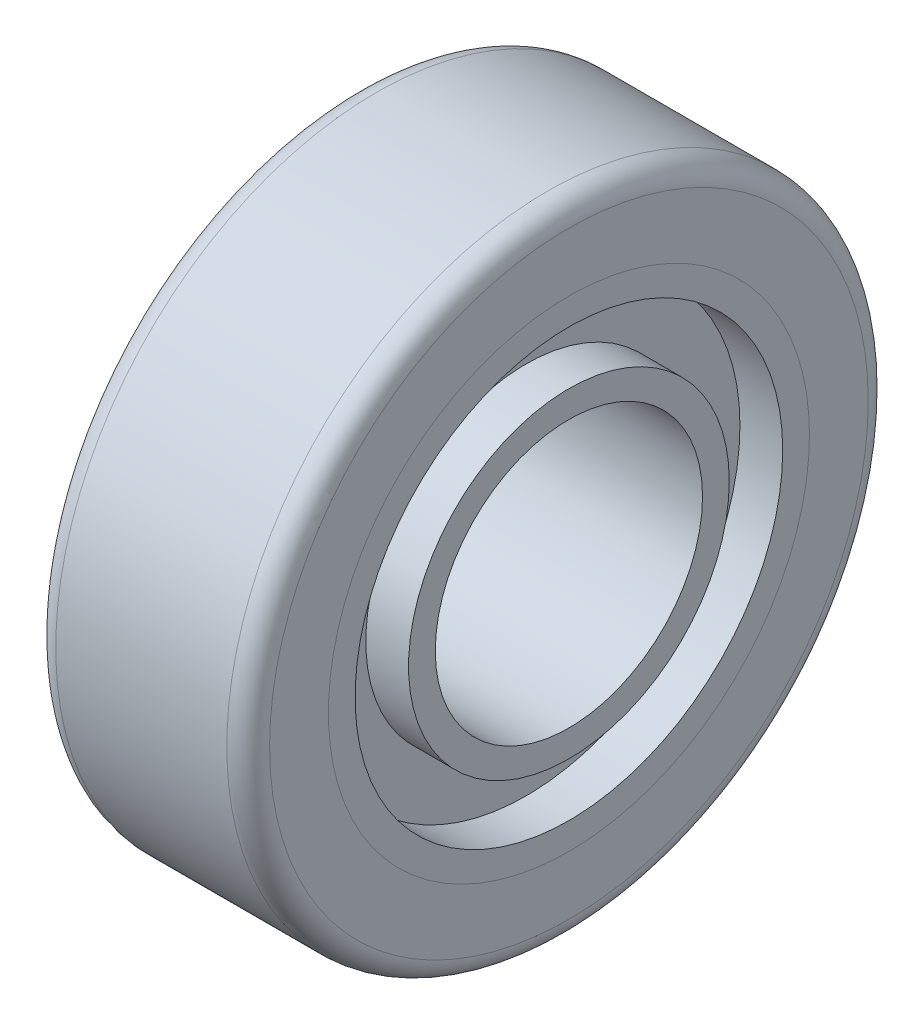
ISO-10303-21;
HEADER;
FILE_DESCRIPTION(('STEP AP214'),'2;1');
FILE_NAME('part.step','',(''),(''),'','','');
FILE_SCHEMA(('AUTOMOTIVE_DESIGN { 1 0 10303 214 1 1 1 1 }'));
ENDSEC;
DATA;
#1=APPLICATION_CONTEXT('core data for automotive mechanical design processes');
#2=APPLICATION_PROTOCOL_DEFINITION('international standard','automotive_design',2000,#1);
#3=PRODUCT_CONTEXT('',#1,'mechanical');
#4=PRODUCT('Part','Part','',(#3));
#5=PRODUCT_RELATED_PRODUCT_CATEGORY('part','',(#4));
#6=PRODUCT_DEFINITION_FORMATION('','',#4);
#7=PRODUCT_DEFINITION_CONTEXT('part definition',#1,'design');
#8=PRODUCT_DEFINITION('design','',#6,#7);
#9=PRODUCT_DEFINITION_SHAPE('','',#8);
#10=(LENGTH_UNIT() NAMED_UNIT(*) SI_UNIT(.MILLI.,.METRE.));
#11=(NAMED_UNIT(*) PLANE_ANGLE_UNIT() SI_UNIT($,.RADIAN.));
#12=(NAMED_UNIT(*) SI_UNIT($,.STERADIAN.) SOLID_ANGLE_UNIT());
#13=UNCERTAINTY_MEASURE_WITH_UNIT(LENGTH_MEASURE(1.E-05),#10,'distance_accuracy_value','');
#14=(GEOMETRIC_REPRESENTATION_CONTEXT(3) GLOBAL_UNCERTAINTY_ASSIGNED_CONTEXT((#13)) GLOBAL_UNIT_ASSIGNED_CONTEXT((#10,
#11,#12)) REPRESENTATION_CONTEXT('',''));
#15=CARTESIAN_POINT('',(0.,0.,0.));
#16=DIRECTION('',(0.,0.,1.));
#17=DIRECTION('',(1.,0.,0.));
#18=AXIS2_PLACEMENT_3D('',#15,#16,#17);
#19=CARTESIAN_POINT('',(0.,0.,0.));
#20=DIRECTION('',(1.,0.,0.));
#21=DIRECTION('',(0.,0.,-1.));
#22=AXIS2_PLACEMENT_3D('',#19,#20,#21);
#23=PLANE('',#22);
#24=CARTESIAN_POINT('',(0.,0.,0.));
#25=DIRECTION('',(1.,0.,0.));
#26=DIRECTION('',(0.,0.,-1.));
#27=AXIS2_PLACEMENT_3D('',#24,#25,#26);
#28=CIRCLE('',#27,15.875);
#29=CARTESIAN_POINT('',(0.,0.,-15.875));
#30=VERTEX_POINT('',#29);
#31=EDGE_CURVE('E68',#30,#30,#28,.T.);
#32=ORIENTED_EDGE('',*,*,#31,.T.);
#33=EDGE_LOOP('',(#32));
#34=FACE_BOUND('',#33,.T.);
#35=CARTESIAN_POINT('',(0.,0.,0.));
#36=DIRECTION('',(1.,0.,0.));
#37=DIRECTION('',(0.,0.,-1.));
#38=AXIS2_PLACEMENT_3D('',#35,#36,#37);
#39=CIRCLE('',#38,19.05);
#40=CARTESIAN_POINT('',(0.,0.,-19.05));
#41=VERTEX_POINT('',#40);
#42=EDGE_CURVE('E83',#41,#41,#39,.T.);
#43=ORIENTED_EDGE('',*,*,#42,.F.);
#44=EDGE_LOOP('',(#43));
#45=FACE_BOUND('',#44,.T.);
#46=ADVANCED_FACE('F46',(#34,#45),#23,.F.);
#47=CARTESIAN_POINT('',(0.,0.,0.));
#48=DIRECTION('',(1.,0.,0.));
#49=DIRECTION('',(0.,0.,-1.));
#50=AXIS2_PLACEMENT_3D('',#47,#48,#49);
#51=CYLINDRICAL_SURFACE('',#50,28.575);
#52=CARTESIAN_POINT('',(0.,0.,0.));
#53=DIRECTION('',(1.,0.,0.));
#54=DIRECTION('',(0.,0.,-1.));
#55=AXIS2_PLACEMENT_3D('',#52,#53,#54);
#56=CIRCLE('',#55,28.575);
#57=CARTESIAN_POINT('',(0.,0.,-28.575));
#58=VERTEX_POINT('',#57);
#59=EDGE_CURVE('E11',#58,#58,#56,.T.);
#60=ORIENTED_EDGE('',*,*,#59,.T.);
#61=EDGE_LOOP('',(#60));
#62=FACE_BOUND('',#61,.T.);
#63=CARTESIAN_POINT('',(25.4,0.,0.));
#64=DIRECTION('',(1.,0.,0.));
#65=DIRECTION('',(0.,0.,-1.));
#66=AXIS2_PLACEMENT_3D('',#63,#64,#65);
#67=CIRCLE('',#66,28.575);
#68=CARTESIAN_POINT('',(25.4,0.,-28.575));
#69=VERTEX_POINT('',#68);
#70=EDGE_CURVE('E50',#69,#69,#67,.T.);
#71=ORIENTED_EDGE('',*,*,#70,.F.);
#72=EDGE_LOOP('',(#71));
#73=FACE_BOUND('',#72,.T.);
#74=ADVANCED_FACE('F48',(#62,#73),#51,.T.);
#75=CARTESIAN_POINT('',(0.,0.,0.));
#76=DIRECTION('',(1.,0.,0.));
#77=DIRECTION('',(0.,0.,-1.));
#78=AXIS2_PLACEMENT_3D('',#75,#76,#77);
#79=CIRCLE('',#78,25.4);
#80=CARTESIAN_POINT('',(0.,0.,-25.4));
#81=VERTEX_POINT('',#80);
#82=EDGE_CURVE('E77',#81,#81,#79,.T.);
#83=ORIENTED_EDGE('',*,*,#82,.T.);
#84=EDGE_LOOP('',(#83));
#85=FACE_BOUND('',#84,.T.);
#86=ORIENTED_EDGE('',*,*,#59,.F.);
#87=EDGE_LOOP('',(#86));
#88=FACE_BOUND('',#87,.T.);
#89=ADVANCED_FACE('F101',(#85,#88),#23,.F.);
#90=CARTESIAN_POINT('',(25.4,0.,0.));
#91=DIRECTION('',(1.,0.,0.));
#92=DIRECTION('',(0.,0.,-1.));
#93=AXIS2_PLACEMENT_3D('',#90,#91,#92);
#94=PLANE('',#93);
#95=CARTESIAN_POINT('',(25.4,0.,0.));
#96=DIRECTION('',(1.,0.,0.));
#97=DIRECTION('',(0.,0.,-1.));
#98=AXIS2_PLACEMENT_3D('',#95,#96,#97);
#99=CIRCLE('',#98,25.4);
#100=CARTESIAN_POINT('',(25.4,0.,-25.4));
#101=VERTEX_POINT('',#100);
#102=EDGE_CURVE('E59',#101,#101,#99,.T.);
#103=ORIENTED_EDGE('',*,*,#102,.F.);
#104=EDGE_LOOP('',(#103));
#105=FACE_BOUND('',#104,.T.);
#106=ORIENTED_EDGE('',*,*,#70,.T.);
#107=EDGE_LOOP('',(#106));
#108=FACE_BOUND('',#107,.T.);
#109=ADVANCED_FACE('F107',(#105,#108),#94,.T.);
#110=CARTESIAN_POINT('',(20.32,0.,0.));
#111=DIRECTION('',(1.,0.,0.));
#112=DIRECTION('',(0.,0.,-1.));
#113=AXIS2_PLACEMENT_3D('',#110,#111,#112);
#114=CYLINDRICAL_SURFACE('',#113,25.4);
#115=CARTESIAN_POINT('',(20.32,0.,0.));
#116=DIRECTION('',(1.,0.,0.));
#117=DIRECTION('',(0.,0.,-1.));
#118=AXIS2_PLACEMENT_3D('',#115,#116,#117);
#119=CIRCLE('',#118,25.4);
#120=CARTESIAN_POINT('',(20.32,0.,-25.4));
#121=VERTEX_POINT('',#120);
#122=EDGE_CURVE('E57',#121,#121,#119,.T.);
#123=ORIENTED_EDGE('',*,*,#122,.F.);
#124=EDGE_LOOP('',(#123));
#125=FACE_BOUND('',#124,.T.);
#126=ORIENTED_EDGE('',*,*,#102,.T.);
#127=EDGE_LOOP('',(#126));
#128=FACE_BOUND('',#127,.T.);
#129=ADVANCED_FACE('F112',(#125,#128),#114,.F.);
#130=CARTESIAN_POINT('',(20.32,0.,0.));
#131=DIRECTION('',(1.,0.,0.));
#132=DIRECTION('',(0.,0.,-1.));
#133=AXIS2_PLACEMENT_3D('',#130,#131,#132);
#134=PLANE('',#133);
#135=CARTESIAN_POINT('',(20.32,0.,0.));
#136=DIRECTION('',(1.,0.,0.));
#137=DIRECTION('',(0.,0.,-1.));
#138=AXIS2_PLACEMENT_3D('',#135,#136,#137);
#139=CIRCLE('',#138,19.05);
#140=CARTESIAN_POINT('',(20.32,0.,-19.05));
#141=VERTEX_POINT('',#140);
#142=EDGE_CURVE('E62',#141,#141,#139,.T.);
#143=ORIENTED_EDGE('',*,*,#142,.F.);
#144=EDGE_LOOP('',(#143));
#145=FACE_BOUND('',#144,.T.);
#146=ORIENTED_EDGE('',*,*,#122,.T.);
#147=EDGE_LOOP('',(#146));
#148=FACE_BOUND('',#147,.T.);
#149=ADVANCED_FACE('F134',(#145,#148),#134,.T.);
#150=CARTESIAN_POINT('',(20.32,0.,0.));
#151=DIRECTION('',(1.,0.,0.));
#152=DIRECTION('',(0.,0.,-1.));
#153=AXIS2_PLACEMENT_3D('',#150,#151,#152);
#154=CYLINDRICAL_SURFACE('',#153,19.05);
#155=ORIENTED_EDGE('',*,*,#142,.T.);
#156=EDGE_LOOP('',(#155));
#157=FACE_BOUND('',#156,.T.);
#158=CARTESIAN_POINT('',(25.4,0.,0.));
#159=DIRECTION('',(1.,0.,0.));
#160=DIRECTION('',(0.,0.,-1.));
#161=AXIS2_PLACEMENT_3D('',#158,#159,#160);
#162=CIRCLE('',#161,19.05);
#163=CARTESIAN_POINT('',(25.4,0.,-19.05));
#164=VERTEX_POINT('',#163);
#165=EDGE_CURVE('E65',#164,#164,#162,.T.);
#166=ORIENTED_EDGE('',*,*,#165,.F.);
#167=EDGE_LOOP('',(#166));
#168=FACE_BOUND('',#167,.T.);
#169=ADVANCED_FACE('F131',(#157,#168),#154,.T.);
#170=CARTESIAN_POINT('',(25.4,0.,0.));
#171=DIRECTION('',(1.,0.,0.));
#172=DIRECTION('',(0.,0.,-1.));
#173=AXIS2_PLACEMENT_3D('',#170,#171,#172);
#174=CIRCLE('',#173,15.875);
#175=CARTESIAN_POINT('',(25.4,0.,-15.875));
#176=VERTEX_POINT('',#175);
#177=EDGE_CURVE('E71',#176,#176,#174,.T.);
#178=ORIENTED_EDGE('',*,*,#177,.F.);
#179=EDGE_LOOP('',(#178));
#180=FACE_BOUND('',#179,.T.);
#181=ORIENTED_EDGE('',*,*,#165,.T.);
#182=EDGE_LOOP('',(#181));
#183=FACE_BOUND('',#182,.T.);
#184=ADVANCED_FACE('F114',(#180,#183),#94,.T.);
#185=CARTESIAN_POINT('',(0.,0.,0.));
#186=DIRECTION('',(1.,0.,0.));
#187=DIRECTION('',(0.,0.,-1.));
#188=AXIS2_PLACEMENT_3D('',#185,#186,#187);
#189=CYLINDRICAL_SURFACE('',#188,15.875);
#190=ORIENTED_EDGE('',*,*,#31,.F.);
#191=EDGE_LOOP('',(#190));
#192=FACE_BOUND('',#191,.T.);
#193=ORIENTED_EDGE('',*,*,#177,.T.);
#194=EDGE_LOOP('',(#193));
#195=FACE_BOUND('',#194,.T.);
#196=ADVANCED_FACE('F124',(#192,#195),#189,.F.);
#197=CARTESIAN_POINT('',(5.08,0.,0.));
#198=DIRECTION('',(-1.,0.,0.));
#199=DIRECTION('',(0.,0.,-1.));
#200=AXIS2_PLACEMENT_3D('',#197,#198,#199);
#201=PLANE('',#200);
#202=CARTESIAN_POINT('',(5.08,0.,0.));
#203=DIRECTION('',(1.,0.,0.));
#204=DIRECTION('',(0.,0.,-1.));
#205=AXIS2_PLACEMENT_3D('',#202,#203,#204);
#206=CIRCLE('',#205,25.4);
#207=CARTESIAN_POINT('',(5.08,0.,-25.4));
#208=VERTEX_POINT('',#207);
#209=EDGE_CURVE('E74',#208,#208,#206,.T.);
#210=ORIENTED_EDGE('',*,*,#209,.F.);
#211=EDGE_LOOP('',(#210));
#212=FACE_BOUND('',#211,.T.);
#213=CARTESIAN_POINT('',(5.08,0.,0.));
#214=DIRECTION('',(1.,0.,0.));
#215=DIRECTION('',(0.,0.,-1.));
#216=AXIS2_PLACEMENT_3D('',#213,#214,#215);
#217=CIRCLE('',#216,19.05);
#218=CARTESIAN_POINT('',(5.08,0.,-19.05));
#219=VERTEX_POINT('',#218);
#220=EDGE_CURVE('E80',#219,#219,#217,.T.);
#221=ORIENTED_EDGE('',*,*,#220,.T.);
#222=EDGE_LOOP('',(#221));
#223=FACE_BOUND('',#222,.T.);
#224=ADVANCED_FACE('F89',(#212,#223),#201,.T.);
#225=CARTESIAN_POINT('',(5.08,0.,0.));
#226=DIRECTION('',(-1.,0.,0.));
#227=DIRECTION('',(0.,0.,1.));
#228=AXIS2_PLACEMENT_3D('',#225,#226,#227);
#229=CYLINDRICAL_SURFACE('',#228,25.4);
#230=ORIENTED_EDGE('',*,*,#209,.T.);
#231=EDGE_LOOP('',(#230));
#232=FACE_BOUND('',#231,.T.);
#233=ORIENTED_EDGE('',*,*,#82,.F.);
#234=EDGE_LOOP('',(#233));
#235=FACE_BOUND('',#234,.T.);
#236=ADVANCED_FACE('F94',(#232,#235),#229,.F.);
#237=CARTESIAN_POINT('',(5.08,0.,0.));
#238=DIRECTION('',(-1.,0.,0.));
#239=DIRECTION('',(0.,0.,1.));
#240=AXIS2_PLACEMENT_3D('',#237,#238,#239);
#241=CYLINDRICAL_SURFACE('',#240,19.05);
#242=ORIENTED_EDGE('',*,*,#220,.F.);
#243=EDGE_LOOP('',(#242));
#244=FACE_BOUND('',#243,.T.);
#245=ORIENTED_EDGE('',*,*,#42,.T.);
#246=EDGE_LOOP('',(#245));
#247=FACE_BOUND('',#246,.T.);
#248=ADVANCED_FACE('F91',(#244,#247),#241,.T.);
#249=CLOSED_SHELL('',(#46,#74,#89,#109,#129,#149,#169,#184,#196,#224,#236,#248));
#250=MANIFOLD_SOLID_BREP('B2',#249);
#251=CARTESIAN_POINT('',(25.4,0.,0.));
#252=DIRECTION('',(-1.,0.,0.));
#253=DIRECTION('',(0.,0.,1.));
#254=AXIS2_PLACEMENT_3D('',#251,#252,#253);
#255=CYLINDRICAL_SURFACE('',#254,38.1);
#256=CARTESIAN_POINT('',(2.54,0.,0.));
#257=DIRECTION('',(1.,0.,0.));
#258=DIRECTION('',(0.,0.,-1.));
#259=AXIS2_PLACEMENT_3D('',#256,#257,#258);
#260=CIRCLE('',#259,38.1);
#261=CARTESIAN_POINT('',(2.54,0.,-38.1));
#262=VERTEX_POINT('',#261);
#263=EDGE_CURVE('E258',#262,#262,#260,.T.);
#264=ORIENTED_EDGE('',*,*,#263,.T.);
#265=EDGE_LOOP('',(#264));
#266=FACE_BOUND('',#265,.T.);
#267=CARTESIAN_POINT('',(22.86,0.,0.));
#268=DIRECTION('',(1.,0.,0.));
#269=DIRECTION('',(0.,0.,-1.));
#270=AXIS2_PLACEMENT_3D('',#267,#268,#269);
#271=CIRCLE('',#270,38.1);
#272=CARTESIAN_POINT('',(22.86,0.,-38.1));
#273=VERTEX_POINT('',#272);
#274=EDGE_CURVE('E262',#273,#273,#271,.F.);
#275=ORIENTED_EDGE('',*,*,#274,.T.);
#276=EDGE_LOOP('',(#275));
#277=FACE_BOUND('',#276,.T.);
#278=ADVANCED_FACE('F247',(#266,#277),#255,.T.);
#279=CARTESIAN_POINT('',(25.4,0.,0.));
#280=DIRECTION('',(1.,0.,0.));
#281=DIRECTION('',(0.,0.,-1.));
#282=AXIS2_PLACEMENT_3D('',#279,#280,#281);
#283=PLANE('',#282);
#284=CARTESIAN_POINT('',(25.4,0.,0.));
#285=DIRECTION('',(1.,0.,0.));
#286=DIRECTION('',(0.,0.,-1.));
#287=AXIS2_PLACEMENT_3D('',#284,#285,#286);
#288=CIRCLE('',#287,28.575);
#289=CARTESIAN_POINT('',(25.4,0.,-28.575));
#290=VERTEX_POINT('',#289);
#291=EDGE_CURVE('E268',#290,#290,#288,.T.);
#292=ORIENTED_EDGE('',*,*,#291,.F.);
#293=EDGE_LOOP('',(#292));
#294=FACE_BOUND('',#293,.T.);
#295=CARTESIAN_POINT('',(25.4,0.,0.));
#296=DIRECTION('',(1.,0.,0.));
#297=DIRECTION('',(0.,0.,-1.));
#298=AXIS2_PLACEMENT_3D('',#295,#296,#297);
#299=CIRCLE('',#298,35.56);
#300=CARTESIAN_POINT('',(25.4,0.,-35.56));
#301=VERTEX_POINT('',#300);
#302=EDGE_CURVE('E45',#301,#301,#299,.T.);
#303=ORIENTED_EDGE('',*,*,#302,.T.);
#304=EDGE_LOOP('',(#303));
#305=FACE_BOUND('',#304,.T.);
#306=ADVANCED_FACE('F282',(#294,#305),#283,.T.);
#307=CARTESIAN_POINT('',(0.,0.,0.));
#308=DIRECTION('',(1.,0.,0.));
#309=DIRECTION('',(0.,0.,-1.));
#310=AXIS2_PLACEMENT_3D('',#307,#308,#309);
#311=PLANE('',#310);
#312=CARTESIAN_POINT('',(0.,0.,0.));
#313=DIRECTION('',(1.,0.,0.));
#314=DIRECTION('',(0.,0.,-1.));
#315=AXIS2_PLACEMENT_3D('',#312,#313,#314);
#316=CIRCLE('',#315,28.575);
#317=CARTESIAN_POINT('',(0.,0.,-28.575));
#318=VERTEX_POINT('',#317);
#319=EDGE_CURVE('E267',#318,#318,#316,.T.);
#320=ORIENTED_EDGE('',*,*,#319,.T.);
#321=EDGE_LOOP('',(#320));
#322=FACE_BOUND('',#321,.T.);
#323=CARTESIAN_POINT('',(0.,0.,0.));
#324=DIRECTION('',(1.,0.,0.));
#325=DIRECTION('',(0.,0.,-1.));
#326=AXIS2_PLACEMENT_3D('',#323,#324,#325);
#327=CIRCLE('',#326,35.56);
#328=CARTESIAN_POINT('',(0.,0.,-35.56));
#329=VERTEX_POINT('',#328);
#330=EDGE_CURVE('E254',#329,#329,#327,.F.);
#331=ORIENTED_EDGE('',*,*,#330,.T.);
#332=EDGE_LOOP('',(#331));
#333=FACE_BOUND('',#332,.T.);
#334=ADVANCED_FACE('F274',(#322,#333),#311,.F.);
#335=CARTESIAN_POINT('',(2.54,0.,0.));
#336=DIRECTION('',(1.,0.,0.));
#337=DIRECTION('',(0.,0.,-1.));
#338=AXIS2_PLACEMENT_3D('',#335,#336,#337);
#339=TOROIDAL_SURFACE('',#338,35.56,2.54);
#340=ORIENTED_EDGE('',*,*,#330,.F.);
#341=EDGE_LOOP('',(#340));
#342=FACE_BOUND('',#341,.T.);
#343=ORIENTED_EDGE('',*,*,#263,.F.);
#344=EDGE_LOOP('',(#343));
#345=FACE_BOUND('',#344,.T.);
#346=ADVANCED_FACE('F289',(#342,#345),#339,.T.);
#347=CARTESIAN_POINT('',(22.86,0.,0.));
#348=DIRECTION('',(1.,0.,0.));
#349=DIRECTION('',(0.,0.,-1.));
#350=AXIS2_PLACEMENT_3D('',#347,#348,#349);
#351=TOROIDAL_SURFACE('',#350,35.56,2.54);
#352=ORIENTED_EDGE('',*,*,#274,.F.);
#353=EDGE_LOOP('',(#352));
#354=FACE_BOUND('',#353,.T.);
#355=ORIENTED_EDGE('',*,*,#302,.F.);
#356=EDGE_LOOP('',(#355));
#357=FACE_BOUND('',#356,.T.);
#358=ADVANCED_FACE('F249',(#354,#357),#351,.T.);
#359=CARTESIAN_POINT('',(0.,0.,0.));
#360=DIRECTION('',(1.,0.,0.));
#361=DIRECTION('',(0.,0.,-1.));
#362=AXIS2_PLACEMENT_3D('',#359,#360,#361);
#363=CYLINDRICAL_SURFACE('',#362,28.575);
#364=ORIENTED_EDGE('',*,*,#319,.F.);
#365=EDGE_LOOP('',(#364));
#366=FACE_BOUND('',#365,.T.);
#367=ORIENTED_EDGE('',*,*,#291,.T.);
#368=EDGE_LOOP('',(#367));
#369=FACE_BOUND('',#368,.T.);
#370=ADVANCED_FACE('F276',(#366,#369),#363,.F.);
#371=CLOSED_SHELL('',(#278,#306,#334,#346,#358,#370));
#372=MANIFOLD_SOLID_BREP('B6',#371);
#373=ADVANCED_BREP_SHAPE_REPRESENTATION('',(#18,#250,#372),#14);
#374=SHAPE_DEFINITION_REPRESENTATION(#9,#373);
ENDSEC;
END-ISO-10303-21;
